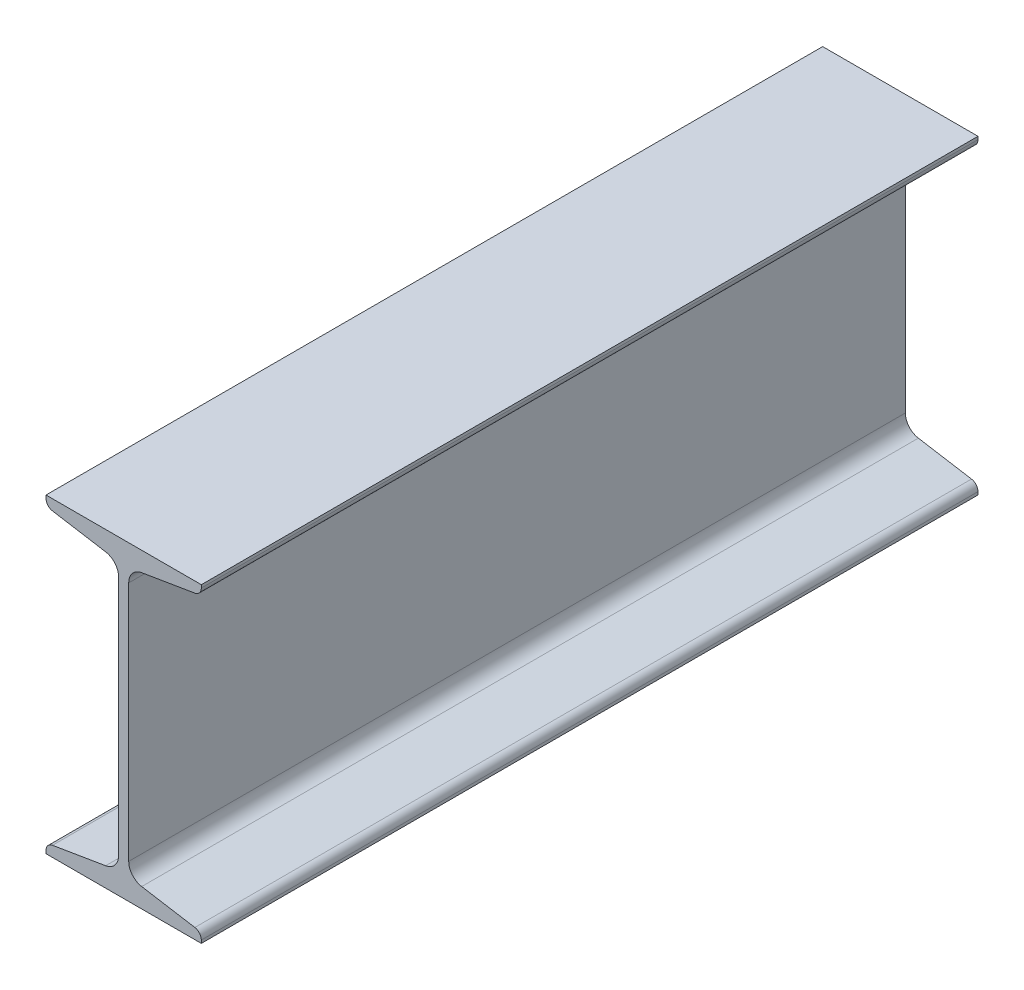
ISO-10303-21;
HEADER;
FILE_DESCRIPTION(('STEP AP214'),'2;1');
FILE_NAME('part.step','',(''),(''),'','','');
FILE_SCHEMA(('AUTOMOTIVE_DESIGN { 1 0 10303 214 1 1 1 1 }'));
ENDSEC;
DATA;
#1=APPLICATION_CONTEXT('core data for automotive mechanical design processes');
#2=APPLICATION_PROTOCOL_DEFINITION('international standard','automotive_design',2000,#1);
#3=PRODUCT_CONTEXT('',#1,'mechanical');
#4=PRODUCT('Part','Part','',(#3));
#5=PRODUCT_RELATED_PRODUCT_CATEGORY('part','',(#4));
#6=PRODUCT_DEFINITION_FORMATION('','',#4);
#7=PRODUCT_DEFINITION_CONTEXT('part definition',#1,'design');
#8=PRODUCT_DEFINITION('design','',#6,#7);
#9=PRODUCT_DEFINITION_SHAPE('','',#8);
#10=(LENGTH_UNIT() NAMED_UNIT(*) SI_UNIT(.MILLI.,.METRE.));
#11=(NAMED_UNIT(*) PLANE_ANGLE_UNIT() SI_UNIT($,.RADIAN.));
#12=(NAMED_UNIT(*) SI_UNIT($,.STERADIAN.) SOLID_ANGLE_UNIT());
#13=UNCERTAINTY_MEASURE_WITH_UNIT(LENGTH_MEASURE(1.E-05),#10,'distance_accuracy_value','');
#14=(GEOMETRIC_REPRESENTATION_CONTEXT(3) GLOBAL_UNCERTAINTY_ASSIGNED_CONTEXT((#13)) GLOBAL_UNIT_ASSIGNED_CONTEXT((#10,
#11,#12)) REPRESENTATION_CONTEXT('',''));
#15=CARTESIAN_POINT('',(0.,0.,0.));
#16=DIRECTION('',(0.,0.,1.));
#17=DIRECTION('',(1.,0.,0.));
#18=AXIS2_PLACEMENT_3D('',#15,#16,#17);
#19=CARTESIAN_POINT('',(120.,-4.51736687650914E-13,300.));
#20=DIRECTION('',(0.,-1.,0.));
#21=DIRECTION('',(1.,0.,0.));
#22=AXIS2_PLACEMENT_3D('',#19,#20,#21);
#23=PLANE('',#22);
#24=DIRECTION('',(-1.,0.,0.));
#25=VECTOR('',#24,1.);
#26=CARTESIAN_POINT('',(120.,-4.51736687650914E-13,-300.));
#27=LINE('',#26,#25);
#28=CARTESIAN_POINT('',(120.,-4.51736687650914E-13,-300.));
#29=VERTEX_POINT('',#28);
#30=CARTESIAN_POINT('',(0.,0.,-300.));
#31=VERTEX_POINT('',#30);
#32=EDGE_CURVE('E238',#29,#31,#27,.T.);
#33=ORIENTED_EDGE('',*,*,#32,.F.);
#34=DIRECTION('',(0.,0.,-1.));
#35=VECTOR('',#34,1.);
#36=CARTESIAN_POINT('',(120.,-4.51736687650914E-13,300.));
#37=LINE('',#36,#35);
#38=CARTESIAN_POINT('',(120.,-4.51736687650914E-13,300.));
#39=VERTEX_POINT('',#38);
#40=EDGE_CURVE('E196',#39,#29,#37,.T.);
#41=ORIENTED_EDGE('',*,*,#40,.F.);
#42=DIRECTION('',(-1.,0.,0.));
#43=VECTOR('',#42,1.);
#44=CARTESIAN_POINT('',(120.,-4.51736687650914E-13,300.));
#45=LINE('',#44,#43);
#46=CARTESIAN_POINT('',(0.,0.,300.));
#47=VERTEX_POINT('',#46);
#48=EDGE_CURVE('E191',#39,#47,#45,.T.);
#49=ORIENTED_EDGE('',*,*,#48,.T.);
#50=DIRECTION('',(0.,0.,-1.));
#51=VECTOR('',#50,1.);
#52=CARTESIAN_POINT('',(0.,0.,300.));
#53=LINE('',#52,#51);
#54=EDGE_CURVE('E174',#47,#31,#53,.T.);
#55=ORIENTED_EDGE('',*,*,#54,.T.);
#56=EDGE_LOOP('',(#33,#41,#49,#55));
#57=FACE_BOUND('',#56,.T.);
#58=ADVANCED_FACE('F37',(#57),#23,.T.);
#59=CARTESIAN_POINT('',(120.,7.32465895539263,300.));
#60=DIRECTION('',(1.,0.,0.));
#61=DIRECTION('',(0.,0.,-1.));
#62=AXIS2_PLACEMENT_3D('',#59,#60,#61);
#63=PLANE('',#62);
#64=DIRECTION('',(0.,-1.,0.));
#65=VECTOR('',#64,1.);
#66=CARTESIAN_POINT('',(120.,7.32465895539263,-300.));
#67=LINE('',#66,#65);
#68=CARTESIAN_POINT('',(120.,2.24195738173786,-300.));
#69=VERTEX_POINT('',#68);
#70=EDGE_CURVE('E197',#69,#29,#67,.T.);
#71=ORIENTED_EDGE('',*,*,#70,.F.);
#72=DIRECTION('',(0.,0.,-1.));
#73=VECTOR('',#72,1.);
#74=CARTESIAN_POINT('',(120.,2.24195738173786,300.));
#75=LINE('',#74,#73);
#76=CARTESIAN_POINT('',(120.,2.24195738173786,300.));
#77=VERTEX_POINT('',#76);
#78=EDGE_CURVE('E310',#69,#77,#75,.F.);
#79=ORIENTED_EDGE('',*,*,#78,.T.);
#80=DIRECTION('',(0.,-1.,0.));
#81=VECTOR('',#80,1.);
#82=CARTESIAN_POINT('',(120.,7.32465895539263,300.));
#83=LINE('',#82,#81);
#84=EDGE_CURVE('E186',#77,#39,#83,.T.);
#85=ORIENTED_EDGE('',*,*,#84,.T.);
#86=ORIENTED_EDGE('',*,*,#40,.T.);
#87=EDGE_LOOP('',(#71,#79,#85,#86));
#88=FACE_BOUND('',#87,.T.);
#89=ADVANCED_FACE('F387',(#88),#63,.T.);
#90=CARTESIAN_POINT('',(73.9270721275245,15.0040404372586,300.));
#91=DIRECTION('',(0.164410656039623,0.986391978972163,0.));
#92=DIRECTION('',(-0.986391978972163,0.164410656039623,0.));
#93=AXIS2_PLACEMENT_3D('',#90,#91,#92);
#94=PLANE('',#93);
#95=DIRECTION('',(0.986391978972163,-0.164410656039623,0.));
#96=VECTOR('',#95,1.);
#97=CARTESIAN_POINT('',(73.9270721275245,15.0040404372586,300.));
#98=LINE('',#97,#96);
#99=CARTESIAN_POINT('',(73.9270721275245,15.0040404372585,300.));
#100=VERTEX_POINT('',#99);
#101=CARTESIAN_POINT('',(114.986463936238,8.16030925557084,300.));
#102=VERTEX_POINT('',#101);
#103=EDGE_CURVE('E234',#100,#102,#98,.T.);
#104=ORIENTED_EDGE('',*,*,#103,.T.);
#105=DIRECTION('',(0.,0.,-1.));
#106=VECTOR('',#105,1.);
#107=CARTESIAN_POINT('',(114.986463936238,8.16030925557084,300.));
#108=LINE('',#107,#106);
#109=CARTESIAN_POINT('',(114.986463936238,8.16030925557084,-300.));
#110=VERTEX_POINT('',#109);
#111=EDGE_CURVE('E277',#102,#110,#108,.T.);
#112=ORIENTED_EDGE('',*,*,#111,.T.);
#113=DIRECTION('',(0.986391978972163,-0.164410656039623,0.));
#114=VECTOR('',#113,1.);
#115=CARTESIAN_POINT('',(73.9270721275245,15.0040404372586,-300.));
#116=LINE('',#115,#114);
#117=CARTESIAN_POINT('',(73.9270721275245,15.0040404372585,-300.));
#118=VERTEX_POINT('',#117);
#119=EDGE_CURVE('E199',#118,#110,#116,.T.);
#120=ORIENTED_EDGE('',*,*,#119,.F.);
#121=DIRECTION('',(0.,0.,-1.));
#122=VECTOR('',#121,1.);
#123=CARTESIAN_POINT('',(73.9270721275245,15.0040404372585,300.));
#124=LINE('',#123,#122);
#125=EDGE_CURVE('E278',#100,#118,#124,.T.);
#126=ORIENTED_EDGE('',*,*,#125,.F.);
#127=EDGE_LOOP('',(#104,#112,#120,#126));
#128=FACE_BOUND('',#127,.T.);
#129=ADVANCED_FACE('F381',(#128),#94,.T.);
#130=CARTESIAN_POINT('',(75.9,26.8407441849245,300.));
#131=DIRECTION('',(0.,0.,-1.));
#132=DIRECTION('',(-1.,0.,0.));
#133=AXIS2_PLACEMENT_3D('',#130,#131,#132);
#134=CYLINDRICAL_SURFACE('',#133,12.);
#135=CARTESIAN_POINT('',(75.9,26.8407441849245,-300.));
#136=DIRECTION('',(0.,0.,1.));
#137=DIRECTION('',(1.,0.,0.));
#138=AXIS2_PLACEMENT_3D('',#135,#136,#137);
#139=CIRCLE('',#138,12.);
#140=CARTESIAN_POINT('',(63.9,26.8407441849245,-300.));
#141=VERTEX_POINT('',#140);
#142=EDGE_CURVE('E271',#141,#118,#139,.T.);
#143=ORIENTED_EDGE('',*,*,#142,.F.);
#144=DIRECTION('',(0.,0.,-1.));
#145=VECTOR('',#144,1.);
#146=CARTESIAN_POINT('',(63.9,26.8407441849245,300.));
#147=LINE('',#146,#145);
#148=CARTESIAN_POINT('',(63.9,26.8407441849245,300.));
#149=VERTEX_POINT('',#148);
#150=EDGE_CURVE('E280',#149,#141,#147,.T.);
#151=ORIENTED_EDGE('',*,*,#150,.F.);
#152=CARTESIAN_POINT('',(75.9,26.8407441849245,300.));
#153=DIRECTION('',(0.,0.,1.));
#154=DIRECTION('',(1.,0.,0.));
#155=AXIS2_PLACEMENT_3D('',#152,#153,#154);
#156=CIRCLE('',#155,12.);
#157=EDGE_CURVE('E231',#149,#100,#156,.T.);
#158=ORIENTED_EDGE('',*,*,#157,.T.);
#159=ORIENTED_EDGE('',*,*,#125,.T.);
#160=EDGE_LOOP('',(#143,#151,#158,#159));
#161=FACE_BOUND('',#160,.T.);
#162=ADVANCED_FACE('F377',(#161),#134,.F.);
#163=CARTESIAN_POINT('',(63.8999999999999,213.159255815075,300.));
#164=DIRECTION('',(1.,0.,0.));
#165=DIRECTION('',(0.,1.,0.));
#166=AXIS2_PLACEMENT_3D('',#163,#164,#165);
#167=PLANE('',#166);
#168=DIRECTION('',(0.,-1.,0.));
#169=VECTOR('',#168,1.);
#170=CARTESIAN_POINT('',(63.8999999999999,213.159255815075,-300.));
#171=LINE('',#170,#169);
#172=CARTESIAN_POINT('',(63.8999999999999,213.159255815075,-300.));
#173=VERTEX_POINT('',#172);
#174=EDGE_CURVE('E268',#173,#141,#171,.T.);
#175=ORIENTED_EDGE('',*,*,#174,.F.);
#176=DIRECTION('',(0.,0.,-1.));
#177=VECTOR('',#176,1.);
#178=CARTESIAN_POINT('',(63.8999999999999,213.159255815075,300.));
#179=LINE('',#178,#177);
#180=CARTESIAN_POINT('',(63.8999999999999,213.159255815075,300.));
#181=VERTEX_POINT('',#180);
#182=EDGE_CURVE('E282',#181,#173,#179,.T.);
#183=ORIENTED_EDGE('',*,*,#182,.F.);
#184=DIRECTION('',(0.,-1.,0.));
#185=VECTOR('',#184,1.);
#186=CARTESIAN_POINT('',(63.8999999999999,213.159255815075,300.));
#187=LINE('',#186,#185);
#188=EDGE_CURVE('E228',#181,#149,#187,.T.);
#189=ORIENTED_EDGE('',*,*,#188,.T.);
#190=ORIENTED_EDGE('',*,*,#150,.T.);
#191=EDGE_LOOP('',(#175,#183,#189,#190));
#192=FACE_BOUND('',#191,.T.);
#193=ADVANCED_FACE('F373',(#192),#167,.T.);
#194=CARTESIAN_POINT('',(75.8999999999999,213.159255815075,300.));
#195=DIRECTION('',(0.,0.,-1.));
#196=DIRECTION('',(-1.,0.,0.));
#197=AXIS2_PLACEMENT_3D('',#194,#195,#196);
#198=CYLINDRICAL_SURFACE('',#197,12.);
#199=CARTESIAN_POINT('',(75.8999999999999,213.159255815075,-300.));
#200=DIRECTION('',(0.,0.,1.));
#201=DIRECTION('',(1.,0.,0.));
#202=AXIS2_PLACEMENT_3D('',#199,#200,#201);
#203=CIRCLE('',#202,12.);
#204=CARTESIAN_POINT('',(73.9270721275244,224.99595956274,-300.));
#205=VERTEX_POINT('',#204);
#206=EDGE_CURVE('E265',#205,#173,#203,.T.);
#207=ORIENTED_EDGE('',*,*,#206,.F.);
#208=DIRECTION('',(0.,0.,-1.));
#209=VECTOR('',#208,1.);
#210=CARTESIAN_POINT('',(73.9270721275244,224.99595956274,300.));
#211=LINE('',#210,#209);
#212=CARTESIAN_POINT('',(73.9270721275244,224.99595956274,300.));
#213=VERTEX_POINT('',#212);
#214=EDGE_CURVE('E284',#213,#205,#211,.T.);
#215=ORIENTED_EDGE('',*,*,#214,.F.);
#216=CARTESIAN_POINT('',(75.8999999999999,213.159255815075,300.));
#217=DIRECTION('',(0.,0.,1.));
#218=DIRECTION('',(1.,0.,0.));
#219=AXIS2_PLACEMENT_3D('',#216,#217,#218);
#220=CIRCLE('',#219,12.);
#221=EDGE_CURVE('E225',#213,#181,#220,.T.);
#222=ORIENTED_EDGE('',*,*,#221,.T.);
#223=ORIENTED_EDGE('',*,*,#182,.T.);
#224=EDGE_LOOP('',(#207,#215,#222,#223));
#225=FACE_BOUND('',#224,.T.);
#226=ADVANCED_FACE('F369',(#225),#198,.F.);
#227=CARTESIAN_POINT('',(120.,232.675341044606,300.));
#228=DIRECTION('',(0.164410656039624,-0.986391978972163,0.));
#229=DIRECTION('',(0.986391978972163,0.164410656039624,0.));
#230=AXIS2_PLACEMENT_3D('',#227,#228,#229);
#231=PLANE('',#230);
#232=DIRECTION('',(-0.986391978972163,-0.164410656039624,0.));
#233=VECTOR('',#232,1.);
#234=CARTESIAN_POINT('',(120.,232.675341044606,-300.));
#235=LINE('',#234,#233);
#236=CARTESIAN_POINT('',(114.986463936238,231.839690744428,-300.));
#237=VERTEX_POINT('',#236);
#238=EDGE_CURVE('E263',#237,#205,#235,.T.);
#239=ORIENTED_EDGE('',*,*,#238,.F.);
#240=DIRECTION('',(0.,0.,-1.));
#241=VECTOR('',#240,1.);
#242=CARTESIAN_POINT('',(114.986463936238,231.839690744428,300.));
#243=LINE('',#242,#241);
#244=CARTESIAN_POINT('',(114.986463936238,231.839690744428,300.));
#245=VERTEX_POINT('',#244);
#246=EDGE_CURVE('E325',#237,#245,#243,.F.);
#247=ORIENTED_EDGE('',*,*,#246,.T.);
#248=DIRECTION('',(-0.986391978972163,-0.164410656039624,0.));
#249=VECTOR('',#248,1.);
#250=CARTESIAN_POINT('',(120.,232.675341044606,300.));
#251=LINE('',#250,#249);
#252=EDGE_CURVE('E223',#245,#213,#251,.T.);
#253=ORIENTED_EDGE('',*,*,#252,.T.);
#254=ORIENTED_EDGE('',*,*,#214,.T.);
#255=EDGE_LOOP('',(#239,#247,#253,#254));
#256=FACE_BOUND('',#255,.T.);
#257=ADVANCED_FACE('F363',(#256),#231,.T.);
#258=CARTESIAN_POINT('',(120.,240.,300.));
#259=DIRECTION('',(1.,0.,0.));
#260=DIRECTION('',(0.,0.,-1.));
#261=AXIS2_PLACEMENT_3D('',#258,#259,#260);
#262=PLANE('',#261);
#263=DIRECTION('',(0.,-1.,0.));
#264=VECTOR('',#263,1.);
#265=CARTESIAN_POINT('',(120.,240.,300.));
#266=LINE('',#265,#264);
#267=CARTESIAN_POINT('',(120.,240.,300.));
#268=VERTEX_POINT('',#267);
#269=CARTESIAN_POINT('',(120.,237.758042618261,300.));
#270=VERTEX_POINT('',#269);
#271=EDGE_CURVE('E220',#268,#270,#266,.T.);
#272=ORIENTED_EDGE('',*,*,#271,.T.);
#273=DIRECTION('',(0.,0.,-1.));
#274=VECTOR('',#273,1.);
#275=CARTESIAN_POINT('',(120.,237.758042618261,300.));
#276=LINE('',#275,#274);
#277=CARTESIAN_POINT('',(120.,237.758042618261,-300.));
#278=VERTEX_POINT('',#277);
#279=EDGE_CURVE('E322',#270,#278,#276,.T.);
#280=ORIENTED_EDGE('',*,*,#279,.T.);
#281=DIRECTION('',(0.,-1.,0.));
#282=VECTOR('',#281,1.);
#283=CARTESIAN_POINT('',(120.,240.,-300.));
#284=LINE('',#283,#282);
#285=CARTESIAN_POINT('',(120.,240.,-300.));
#286=VERTEX_POINT('',#285);
#287=EDGE_CURVE('E260',#286,#278,#284,.T.);
#288=ORIENTED_EDGE('',*,*,#287,.F.);
#289=DIRECTION('',(0.,0.,-1.));
#290=VECTOR('',#289,1.);
#291=CARTESIAN_POINT('',(120.,240.,300.));
#292=LINE('',#291,#290);
#293=EDGE_CURVE('E287',#268,#286,#292,.T.);
#294=ORIENTED_EDGE('',*,*,#293,.F.);
#295=EDGE_LOOP('',(#272,#280,#288,#294));
#296=FACE_BOUND('',#295,.T.);
#297=ADVANCED_FACE('F355',(#296),#262,.T.);
#298=CARTESIAN_POINT('',(0.,240.,300.));
#299=DIRECTION('',(0.,1.,0.));
#300=DIRECTION('',(0.,0.,1.));
#301=AXIS2_PLACEMENT_3D('',#298,#299,#300);
#302=PLANE('',#301);
#303=DIRECTION('',(1.,0.,0.));
#304=VECTOR('',#303,1.);
#305=CARTESIAN_POINT('',(0.,240.,-300.));
#306=LINE('',#305,#304);
#307=CARTESIAN_POINT('',(0.,240.,-300.));
#308=VERTEX_POINT('',#307);
#309=EDGE_CURVE('E257',#308,#286,#306,.T.);
#310=ORIENTED_EDGE('',*,*,#309,.F.);
#311=DIRECTION('',(0.,0.,-1.));
#312=VECTOR('',#311,1.);
#313=CARTESIAN_POINT('',(0.,240.,300.));
#314=LINE('',#313,#312);
#315=CARTESIAN_POINT('',(0.,240.,300.));
#316=VERTEX_POINT('',#315);
#317=EDGE_CURVE('E289',#316,#308,#314,.T.);
#318=ORIENTED_EDGE('',*,*,#317,.F.);
#319=DIRECTION('',(1.,0.,0.));
#320=VECTOR('',#319,1.);
#321=CARTESIAN_POINT('',(0.,240.,300.));
#322=LINE('',#321,#320);
#323=EDGE_CURVE('E217',#316,#268,#322,.T.);
#324=ORIENTED_EDGE('',*,*,#323,.T.);
#325=ORIENTED_EDGE('',*,*,#293,.T.);
#326=EDGE_LOOP('',(#310,#318,#324,#325));
#327=FACE_BOUND('',#326,.T.);
#328=ADVANCED_FACE('F352',(#327),#302,.T.);
#329=CARTESIAN_POINT('',(0.,232.675341044606,300.));
#330=DIRECTION('',(-1.,0.,0.));
#331=DIRECTION('',(0.,-1.,0.));
#332=AXIS2_PLACEMENT_3D('',#329,#330,#331);
#333=PLANE('',#332);
#334=DIRECTION('',(0.,1.,0.));
#335=VECTOR('',#334,1.);
#336=CARTESIAN_POINT('',(0.,232.675341044606,-300.));
#337=LINE('',#336,#335);
#338=CARTESIAN_POINT('',(0.,237.758042618261,-300.));
#339=VERTEX_POINT('',#338);
#340=EDGE_CURVE('E255',#339,#308,#337,.T.);
#341=ORIENTED_EDGE('',*,*,#340,.F.);
#342=DIRECTION('',(0.,0.,-1.));
#343=VECTOR('',#342,1.);
#344=CARTESIAN_POINT('',(0.,237.758042618261,300.));
#345=LINE('',#344,#343);
#346=CARTESIAN_POINT('',(0.,237.758042618261,300.));
#347=VERTEX_POINT('',#346);
#348=EDGE_CURVE('E11',#339,#347,#345,.F.);
#349=ORIENTED_EDGE('',*,*,#348,.T.);
#350=DIRECTION('',(0.,1.,0.));
#351=VECTOR('',#350,1.);
#352=CARTESIAN_POINT('',(0.,232.675341044606,300.));
#353=LINE('',#352,#351);
#354=EDGE_CURVE('E215',#347,#316,#353,.T.);
#355=ORIENTED_EDGE('',*,*,#354,.T.);
#356=ORIENTED_EDGE('',*,*,#317,.T.);
#357=EDGE_LOOP('',(#341,#349,#355,#356));
#358=FACE_BOUND('',#357,.T.);
#359=ADVANCED_FACE('F347',(#358),#333,.T.);
#360=CARTESIAN_POINT('',(46.0729278724754,224.99595956274,300.));
#361=DIRECTION('',(-0.164410656039623,-0.986391978972163,0.));
#362=DIRECTION('',(0.986391978972163,-0.164410656039623,0.));
#363=AXIS2_PLACEMENT_3D('',#360,#361,#362);
#364=PLANE('',#363);
#365=DIRECTION('',(-0.986391978972163,0.164410656039623,0.));
#366=VECTOR('',#365,1.);
#367=CARTESIAN_POINT('',(46.0729278724754,224.99595956274,300.));
#368=LINE('',#367,#366);
#369=CARTESIAN_POINT('',(46.0729278724754,224.99595956274,300.));
#370=VERTEX_POINT('',#369);
#371=CARTESIAN_POINT('',(5.01353606376219,231.839690744428,300.));
#372=VERTEX_POINT('',#371);
#373=EDGE_CURVE('E212',#370,#372,#368,.T.);
#374=ORIENTED_EDGE('',*,*,#373,.T.);
#375=DIRECTION('',(0.,0.,-1.));
#376=VECTOR('',#375,1.);
#377=CARTESIAN_POINT('',(5.01353606376219,231.839690744428,300.));
#378=LINE('',#377,#376);
#379=CARTESIAN_POINT('',(5.01353606376219,231.839690744428,-300.));
#380=VERTEX_POINT('',#379);
#381=EDGE_CURVE('E45',#372,#380,#378,.T.);
#382=ORIENTED_EDGE('',*,*,#381,.T.);
#383=DIRECTION('',(-0.986391978972163,0.164410656039623,0.));
#384=VECTOR('',#383,1.);
#385=CARTESIAN_POINT('',(46.0729278724754,224.99595956274,-300.));
#386=LINE('',#385,#384);
#387=CARTESIAN_POINT('',(46.0729278724754,224.99595956274,-300.));
#388=VERTEX_POINT('',#387);
#389=EDGE_CURVE('E252',#388,#380,#386,.T.);
#390=ORIENTED_EDGE('',*,*,#389,.F.);
#391=DIRECTION('',(0.,0.,-1.));
#392=VECTOR('',#391,1.);
#393=CARTESIAN_POINT('',(46.0729278724754,224.99595956274,300.));
#394=LINE('',#393,#392);
#395=EDGE_CURVE('E292',#370,#388,#394,.T.);
#396=ORIENTED_EDGE('',*,*,#395,.F.);
#397=EDGE_LOOP('',(#374,#382,#390,#396));
#398=FACE_BOUND('',#397,.T.);
#399=ADVANCED_FACE('F330',(#398),#364,.T.);
#400=CARTESIAN_POINT('',(44.0999999999999,213.159255815075,300.));
#401=DIRECTION('',(0.,0.,-1.));
#402=DIRECTION('',(-1.,0.,0.));
#403=AXIS2_PLACEMENT_3D('',#400,#401,#402);
#404=CYLINDRICAL_SURFACE('',#403,12.);
#405=CARTESIAN_POINT('',(44.0999999999999,213.159255815075,-300.));
#406=DIRECTION('',(0.,0.,1.));
#407=DIRECTION('',(1.,0.,0.));
#408=AXIS2_PLACEMENT_3D('',#405,#406,#407);
#409=CIRCLE('',#408,12.);
#410=CARTESIAN_POINT('',(56.0999999999999,213.159255815075,-300.));
#411=VERTEX_POINT('',#410);
#412=EDGE_CURVE('E249',#411,#388,#409,.T.);
#413=ORIENTED_EDGE('',*,*,#412,.F.);
#414=DIRECTION('',(0.,0.,-1.));
#415=VECTOR('',#414,1.);
#416=CARTESIAN_POINT('',(56.0999999999999,213.159255815075,300.));
#417=LINE('',#416,#415);
#418=CARTESIAN_POINT('',(56.0999999999999,213.159255815075,300.));
#419=VERTEX_POINT('',#418);
#420=EDGE_CURVE('E294',#419,#411,#417,.T.);
#421=ORIENTED_EDGE('',*,*,#420,.F.);
#422=CARTESIAN_POINT('',(44.0999999999999,213.159255815075,300.));
#423=DIRECTION('',(0.,0.,1.));
#424=DIRECTION('',(1.,0.,0.));
#425=AXIS2_PLACEMENT_3D('',#422,#423,#424);
#426=CIRCLE('',#425,12.);
#427=EDGE_CURVE('E209',#419,#370,#426,.T.);
#428=ORIENTED_EDGE('',*,*,#427,.T.);
#429=ORIENTED_EDGE('',*,*,#395,.T.);
#430=EDGE_LOOP('',(#413,#421,#428,#429));
#431=FACE_BOUND('',#430,.T.);
#432=ADVANCED_FACE('F340',(#431),#404,.F.);
#433=CARTESIAN_POINT('',(56.1,26.8407441849245,300.));
#434=DIRECTION('',(-1.,0.,0.));
#435=DIRECTION('',(0.,-1.,0.));
#436=AXIS2_PLACEMENT_3D('',#433,#434,#435);
#437=PLANE('',#436);
#438=DIRECTION('',(0.,1.,0.));
#439=VECTOR('',#438,1.);
#440=CARTESIAN_POINT('',(56.1,26.8407441849245,-300.));
#441=LINE('',#440,#439);
#442=CARTESIAN_POINT('',(56.1,26.8407441849245,-300.));
#443=VERTEX_POINT('',#442);
#444=EDGE_CURVE('E246',#443,#411,#441,.T.);
#445=ORIENTED_EDGE('',*,*,#444,.F.);
#446=DIRECTION('',(0.,0.,-1.));
#447=VECTOR('',#446,1.);
#448=CARTESIAN_POINT('',(56.1,26.8407441849245,300.));
#449=LINE('',#448,#447);
#450=CARTESIAN_POINT('',(56.1,26.8407441849245,300.));
#451=VERTEX_POINT('',#450);
#452=EDGE_CURVE('E296',#451,#443,#449,.T.);
#453=ORIENTED_EDGE('',*,*,#452,.F.);
#454=DIRECTION('',(0.,1.,0.));
#455=VECTOR('',#454,1.);
#456=CARTESIAN_POINT('',(56.1,26.8407441849245,300.));
#457=LINE('',#456,#455);
#458=EDGE_CURVE('E206',#451,#419,#457,.T.);
#459=ORIENTED_EDGE('',*,*,#458,.T.);
#460=ORIENTED_EDGE('',*,*,#420,.T.);
#461=EDGE_LOOP('',(#445,#453,#459,#460));
#462=FACE_BOUND('',#461,.T.);
#463=ADVANCED_FACE('F415',(#462),#437,.T.);
#464=CARTESIAN_POINT('',(44.1,26.8407441849245,300.));
#465=DIRECTION('',(0.,0.,-1.));
#466=DIRECTION('',(-1.,0.,0.));
#467=AXIS2_PLACEMENT_3D('',#464,#465,#466);
#468=CYLINDRICAL_SURFACE('',#467,12.);
#469=CARTESIAN_POINT('',(44.1,26.8407441849245,-300.));
#470=DIRECTION('',(0.,0.,1.));
#471=DIRECTION('',(1.,0.,0.));
#472=AXIS2_PLACEMENT_3D('',#469,#470,#471);
#473=CIRCLE('',#472,12.);
#474=CARTESIAN_POINT('',(46.0729278724754,15.0040404372586,-300.));
#475=VERTEX_POINT('',#474);
#476=EDGE_CURVE('E243',#475,#443,#473,.T.);
#477=ORIENTED_EDGE('',*,*,#476,.F.);
#478=DIRECTION('',(0.,0.,-1.));
#479=VECTOR('',#478,1.);
#480=CARTESIAN_POINT('',(46.0729278724754,15.0040404372586,300.));
#481=LINE('',#480,#479);
#482=CARTESIAN_POINT('',(46.0729278724754,15.0040404372586,300.));
#483=VERTEX_POINT('',#482);
#484=EDGE_CURVE('E185',#483,#475,#481,.T.);
#485=ORIENTED_EDGE('',*,*,#484,.F.);
#486=CARTESIAN_POINT('',(44.1,26.8407441849245,300.));
#487=DIRECTION('',(0.,0.,1.));
#488=DIRECTION('',(1.,0.,0.));
#489=AXIS2_PLACEMENT_3D('',#486,#487,#488);
#490=CIRCLE('',#489,12.);
#491=EDGE_CURVE('E203',#483,#451,#490,.T.);
#492=ORIENTED_EDGE('',*,*,#491,.T.);
#493=ORIENTED_EDGE('',*,*,#452,.T.);
#494=EDGE_LOOP('',(#477,#485,#492,#493));
#495=FACE_BOUND('',#494,.T.);
#496=ADVANCED_FACE('F412',(#495),#468,.F.);
#497=CARTESIAN_POINT('',(0.,7.32465895539264,300.));
#498=DIRECTION('',(-0.164410656039623,0.986391978972163,0.));
#499=DIRECTION('',(-0.986391978972163,-0.164410656039623,0.));
#500=AXIS2_PLACEMENT_3D('',#497,#498,#499);
#501=PLANE('',#500);
#502=DIRECTION('',(0.986391978972163,0.164410656039623,0.));
#503=VECTOR('',#502,1.);
#504=CARTESIAN_POINT('',(0.,7.32465895539264,-300.));
#505=LINE('',#504,#503);
#506=CARTESIAN_POINT('',(5.01353606376226,8.16030925557085,-300.));
#507=VERTEX_POINT('',#506);
#508=EDGE_CURVE('E241',#507,#475,#505,.T.);
#509=ORIENTED_EDGE('',*,*,#508,.F.);
#510=DIRECTION('',(0.,0.,-1.));
#511=VECTOR('',#510,1.);
#512=CARTESIAN_POINT('',(5.01353606376225,8.16030925557085,300.));
#513=LINE('',#512,#511);
#514=CARTESIAN_POINT('',(5.01353606376226,8.16030925557085,300.));
#515=VERTEX_POINT('',#514);
#516=EDGE_CURVE('E60',#507,#515,#513,.F.);
#517=ORIENTED_EDGE('',*,*,#516,.T.);
#518=DIRECTION('',(0.986391978972163,0.164410656039623,0.));
#519=VECTOR('',#518,1.);
#520=CARTESIAN_POINT('',(0.,7.32465895539264,300.));
#521=LINE('',#520,#519);
#522=EDGE_CURVE('E192',#515,#483,#521,.T.);
#523=ORIENTED_EDGE('',*,*,#522,.T.);
#524=ORIENTED_EDGE('',*,*,#484,.T.);
#525=EDGE_LOOP('',(#509,#517,#523,#524));
#526=FACE_BOUND('',#525,.T.);
#527=ADVANCED_FACE('F409',(#526),#501,.T.);
#528=CARTESIAN_POINT('',(0.,0.,300.));
#529=DIRECTION('',(-1.,0.,0.));
#530=DIRECTION('',(0.,-1.,0.));
#531=AXIS2_PLACEMENT_3D('',#528,#529,#530);
#532=PLANE('',#531);
#533=DIRECTION('',(0.,1.,0.));
#534=VECTOR('',#533,1.);
#535=CARTESIAN_POINT('',(0.,0.,300.));
#536=LINE('',#535,#534);
#537=CARTESIAN_POINT('',(0.,2.24195738173785,300.));
#538=VERTEX_POINT('',#537);
#539=EDGE_CURVE('E177',#47,#538,#536,.T.);
#540=ORIENTED_EDGE('',*,*,#539,.T.);
#541=DIRECTION('',(0.,0.,-1.));
#542=VECTOR('',#541,1.);
#543=CARTESIAN_POINT('',(0.,2.24195738173785,300.));
#544=LINE('',#543,#542);
#545=CARTESIAN_POINT('',(0.,2.24195738173785,-300.));
#546=VERTEX_POINT('',#545);
#547=EDGE_CURVE('E319',#538,#546,#544,.T.);
#548=ORIENTED_EDGE('',*,*,#547,.T.);
#549=DIRECTION('',(0.,1.,0.));
#550=VECTOR('',#549,1.);
#551=CARTESIAN_POINT('',(0.,0.,-300.));
#552=LINE('',#551,#550);
#553=EDGE_CURVE('E180',#31,#546,#552,.T.);
#554=ORIENTED_EDGE('',*,*,#553,.F.);
#555=ORIENTED_EDGE('',*,*,#54,.F.);
#556=EDGE_LOOP('',(#540,#548,#554,#555));
#557=FACE_BOUND('',#556,.T.);
#558=ADVANCED_FACE('F175',(#557),#532,.T.);
#559=CARTESIAN_POINT('',(44.1,26.8407441849245,300.));
#560=DIRECTION('',(0.,0.,1.));
#561=DIRECTION('',(1.,0.,0.));
#562=AXIS2_PLACEMENT_3D('',#559,#560,#561);
#563=PLANE('',#562);
#564=ORIENTED_EDGE('',*,*,#84,.F.);
#565=CARTESIAN_POINT('',(114.,2.24195738173786,300.));
#566=DIRECTION('',(0.,0.,1.));
#567=DIRECTION('',(1.,0.,0.));
#568=AXIS2_PLACEMENT_3D('',#565,#566,#567);
#569=CIRCLE('',#568,6.);
#570=EDGE_CURVE('E317',#77,#102,#569,.T.);
#571=ORIENTED_EDGE('',*,*,#570,.T.);
#572=ORIENTED_EDGE('',*,*,#103,.F.);
#573=ORIENTED_EDGE('',*,*,#157,.F.);
#574=ORIENTED_EDGE('',*,*,#188,.F.);
#575=ORIENTED_EDGE('',*,*,#221,.F.);
#576=ORIENTED_EDGE('',*,*,#252,.F.);
#577=CARTESIAN_POINT('',(114.,237.758042618261,300.));
#578=DIRECTION('',(0.,0.,1.));
#579=DIRECTION('',(1.,0.,0.));
#580=AXIS2_PLACEMENT_3D('',#577,#578,#579);
#581=CIRCLE('',#580,6.);
#582=EDGE_CURVE('E314',#245,#270,#581,.T.);
#583=ORIENTED_EDGE('',*,*,#582,.T.);
#584=ORIENTED_EDGE('',*,*,#271,.F.);
#585=ORIENTED_EDGE('',*,*,#323,.F.);
#586=ORIENTED_EDGE('',*,*,#354,.F.);
#587=CARTESIAN_POINT('',(5.99999999999993,237.758042618261,300.));
#588=DIRECTION('',(0.,0.,1.));
#589=DIRECTION('',(1.,0.,0.));
#590=AXIS2_PLACEMENT_3D('',#587,#588,#589);
#591=CIRCLE('',#590,6.);
#592=EDGE_CURVE('E312',#347,#372,#591,.T.);
#593=ORIENTED_EDGE('',*,*,#592,.T.);
#594=ORIENTED_EDGE('',*,*,#373,.F.);
#595=ORIENTED_EDGE('',*,*,#427,.F.);
#596=ORIENTED_EDGE('',*,*,#458,.F.);
#597=ORIENTED_EDGE('',*,*,#491,.F.);
#598=ORIENTED_EDGE('',*,*,#522,.F.);
#599=CARTESIAN_POINT('',(5.99999999999999,2.24195738173787,300.));
#600=DIRECTION('',(0.,0.,1.));
#601=DIRECTION('',(1.,0.,0.));
#602=AXIS2_PLACEMENT_3D('',#599,#600,#601);
#603=CIRCLE('',#602,6.);
#604=EDGE_CURVE('E52',#515,#538,#603,.T.);
#605=ORIENTED_EDGE('',*,*,#604,.T.);
#606=ORIENTED_EDGE('',*,*,#539,.F.);
#607=ORIENTED_EDGE('',*,*,#48,.F.);
#608=EDGE_LOOP('',(#564,#571,#572,#573,#574,#575,#576,#583,#584,#585,#586,#593,#594,#595,#596,
#597,#598,#605,#606,#607));
#609=FACE_BOUND('',#608,.T.);
#610=ADVANCED_FACE('F190',(#609),#563,.T.);
#611=CARTESIAN_POINT('',(44.1,26.8407441849245,-300.));
#612=DIRECTION('',(0.,0.,1.));
#613=DIRECTION('',(1.,0.,0.));
#614=AXIS2_PLACEMENT_3D('',#611,#612,#613);
#615=PLANE('',#614);
#616=ORIENTED_EDGE('',*,*,#119,.T.);
#617=CARTESIAN_POINT('',(114.,2.24195738173786,-300.));
#618=DIRECTION('',(0.,0.,1.));
#619=DIRECTION('',(1.,0.,0.));
#620=AXIS2_PLACEMENT_3D('',#617,#618,#619);
#621=CIRCLE('',#620,6.);
#622=EDGE_CURVE('E308',#110,#69,#621,.F.);
#623=ORIENTED_EDGE('',*,*,#622,.T.);
#624=ORIENTED_EDGE('',*,*,#70,.T.);
#625=ORIENTED_EDGE('',*,*,#32,.T.);
#626=ORIENTED_EDGE('',*,*,#553,.T.);
#627=CARTESIAN_POINT('',(5.99999999999999,2.24195738173787,-300.));
#628=DIRECTION('',(0.,0.,1.));
#629=DIRECTION('',(1.,0.,0.));
#630=AXIS2_PLACEMENT_3D('',#627,#628,#629);
#631=CIRCLE('',#630,6.);
#632=EDGE_CURVE('E306',#546,#507,#631,.F.);
#633=ORIENTED_EDGE('',*,*,#632,.T.);
#634=ORIENTED_EDGE('',*,*,#508,.T.);
#635=ORIENTED_EDGE('',*,*,#476,.T.);
#636=ORIENTED_EDGE('',*,*,#444,.T.);
#637=ORIENTED_EDGE('',*,*,#412,.T.);
#638=ORIENTED_EDGE('',*,*,#389,.T.);
#639=CARTESIAN_POINT('',(5.99999999999993,237.758042618261,-300.));
#640=DIRECTION('',(0.,0.,1.));
#641=DIRECTION('',(1.,0.,0.));
#642=AXIS2_PLACEMENT_3D('',#639,#640,#641);
#643=CIRCLE('',#642,6.);
#644=EDGE_CURVE('E302',#380,#339,#643,.F.);
#645=ORIENTED_EDGE('',*,*,#644,.T.);
#646=ORIENTED_EDGE('',*,*,#340,.T.);
#647=ORIENTED_EDGE('',*,*,#309,.T.);
#648=ORIENTED_EDGE('',*,*,#287,.T.);
#649=CARTESIAN_POINT('',(114.,237.758042618261,-300.));
#650=DIRECTION('',(0.,0.,1.));
#651=DIRECTION('',(1.,0.,0.));
#652=AXIS2_PLACEMENT_3D('',#649,#650,#651);
#653=CIRCLE('',#652,6.);
#654=EDGE_CURVE('E304',#278,#237,#653,.F.);
#655=ORIENTED_EDGE('',*,*,#654,.T.);
#656=ORIENTED_EDGE('',*,*,#238,.T.);
#657=ORIENTED_EDGE('',*,*,#206,.T.);
#658=ORIENTED_EDGE('',*,*,#174,.T.);
#659=ORIENTED_EDGE('',*,*,#142,.T.);
#660=EDGE_LOOP('',(#616,#623,#624,#625,#626,#633,#634,#635,#636,#637,#638,#645,#646,#647,#648,
#655,#656,#657,#658,#659));
#661=FACE_BOUND('',#660,.T.);
#662=ADVANCED_FACE('F335',(#661),#615,.F.);
#663=CARTESIAN_POINT('',(114.,2.24195738173786,300.));
#664=DIRECTION('',(0.,0.,-1.));
#665=DIRECTION('',(-1.,0.,0.));
#666=AXIS2_PLACEMENT_3D('',#663,#664,#665);
#667=CYLINDRICAL_SURFACE('',#666,6.);
#668=ORIENTED_EDGE('',*,*,#570,.F.);
#669=ORIENTED_EDGE('',*,*,#78,.F.);
#670=ORIENTED_EDGE('',*,*,#622,.F.);
#671=ORIENTED_EDGE('',*,*,#111,.F.);
#672=EDGE_LOOP('',(#668,#669,#670,#671));
#673=FACE_BOUND('',#672,.T.);
#674=ADVANCED_FACE('F389',(#673),#667,.T.);
#675=CARTESIAN_POINT('',(5.99999999999999,2.24195738173787,300.));
#676=DIRECTION('',(0.,0.,-1.));
#677=DIRECTION('',(-1.,0.,0.));
#678=AXIS2_PLACEMENT_3D('',#675,#676,#677);
#679=CYLINDRICAL_SURFACE('',#678,6.);
#680=ORIENTED_EDGE('',*,*,#604,.F.);
#681=ORIENTED_EDGE('',*,*,#516,.F.);
#682=ORIENTED_EDGE('',*,*,#632,.F.);
#683=ORIENTED_EDGE('',*,*,#547,.F.);
#684=EDGE_LOOP('',(#680,#681,#682,#683));
#685=FACE_BOUND('',#684,.T.);
#686=ADVANCED_FACE('F391',(#685),#679,.T.);
#687=CARTESIAN_POINT('',(114.,237.758042618261,300.));
#688=DIRECTION('',(0.,0.,-1.));
#689=DIRECTION('',(-1.,0.,0.));
#690=AXIS2_PLACEMENT_3D('',#687,#688,#689);
#691=CYLINDRICAL_SURFACE('',#690,6.);
#692=ORIENTED_EDGE('',*,*,#582,.F.);
#693=ORIENTED_EDGE('',*,*,#246,.F.);
#694=ORIENTED_EDGE('',*,*,#654,.F.);
#695=ORIENTED_EDGE('',*,*,#279,.F.);
#696=EDGE_LOOP('',(#692,#693,#694,#695));
#697=FACE_BOUND('',#696,.T.);
#698=ADVANCED_FACE('F359',(#697),#691,.T.);
#699=CARTESIAN_POINT('',(5.99999999999993,237.758042618261,300.));
#700=DIRECTION('',(0.,0.,-1.));
#701=DIRECTION('',(-1.,0.,0.));
#702=AXIS2_PLACEMENT_3D('',#699,#700,#701);
#703=CYLINDRICAL_SURFACE('',#702,6.);
#704=ORIENTED_EDGE('',*,*,#592,.F.);
#705=ORIENTED_EDGE('',*,*,#348,.F.);
#706=ORIENTED_EDGE('',*,*,#644,.F.);
#707=ORIENTED_EDGE('',*,*,#381,.F.);
#708=EDGE_LOOP('',(#704,#705,#706,#707));
#709=FACE_BOUND('',#708,.T.);
#710=ADVANCED_FACE('F39',(#709),#703,.T.);
#711=CLOSED_SHELL('',(#58,#89,#129,#162,#193,#226,#257,#297,#328,#359,#399,#432,#463,#496,#527,
#558,#610,#662,#674,#686,#698,#710));
#712=MANIFOLD_SOLID_BREP('B2',#711);
#713=ADVANCED_BREP_SHAPE_REPRESENTATION('',(#18,#712),#14);
#714=SHAPE_DEFINITION_REPRESENTATION(#9,#713);
ENDSEC;
END-ISO-10303-21;
